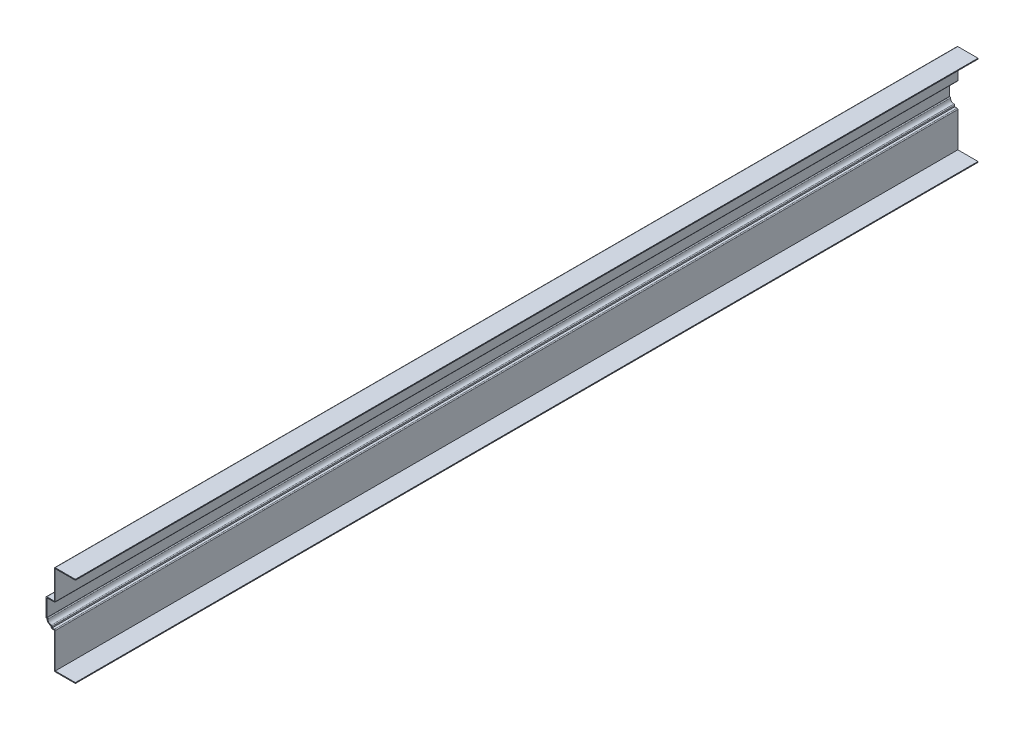
ISO-10303-21;
HEADER;
FILE_DESCRIPTION(('STEP AP214'),'2;1');
FILE_NAME('part.step','',(''),(''),'','','');
FILE_SCHEMA(('AUTOMOTIVE_DESIGN { 1 0 10303 214 1 1 1 1 }'));
ENDSEC;
DATA;
#1=APPLICATION_CONTEXT('core data for automotive mechanical design processes');
#2=APPLICATION_PROTOCOL_DEFINITION('international standard','automotive_design',2000,#1);
#3=PRODUCT_CONTEXT('',#1,'mechanical');
#4=PRODUCT('Part','Part','',(#3));
#5=PRODUCT_RELATED_PRODUCT_CATEGORY('part','',(#4));
#6=PRODUCT_DEFINITION_FORMATION('','',#4);
#7=PRODUCT_DEFINITION_CONTEXT('part definition',#1,'design');
#8=PRODUCT_DEFINITION('design','',#6,#7);
#9=PRODUCT_DEFINITION_SHAPE('','',#8);
#10=(LENGTH_UNIT() NAMED_UNIT(*) SI_UNIT(.MILLI.,.METRE.));
#11=(NAMED_UNIT(*) PLANE_ANGLE_UNIT() SI_UNIT($,.RADIAN.));
#12=(NAMED_UNIT(*) SI_UNIT($,.STERADIAN.) SOLID_ANGLE_UNIT());
#13=UNCERTAINTY_MEASURE_WITH_UNIT(LENGTH_MEASURE(1.E-05),#10,'distance_accuracy_value','');
#14=(GEOMETRIC_REPRESENTATION_CONTEXT(3) GLOBAL_UNCERTAINTY_ASSIGNED_CONTEXT((#13)) GLOBAL_UNIT_ASSIGNED_CONTEXT((#10,
#11,#12)) REPRESENTATION_CONTEXT('',''));
#15=CARTESIAN_POINT('',(0.,0.,0.));
#16=DIRECTION('',(0.,0.,1.));
#17=DIRECTION('',(1.,0.,0.));
#18=AXIS2_PLACEMENT_3D('',#15,#16,#17);
#19=CARTESIAN_POINT('',(-31.75,135.255,-1365.25));
#20=DIRECTION('',(0.,-1.,0.));
#21=DIRECTION('',(0.,0.,-1.));
#22=AXIS2_PLACEMENT_3D('',#19,#20,#21);
#23=PLANE('',#22);
#24=DIRECTION('',(1.,0.,0.));
#25=VECTOR('',#24,1.);
#26=CARTESIAN_POINT('',(-31.75,135.255,0.));
#27=LINE('',#26,#25);
#28=CARTESIAN_POINT('',(-30.48,135.255,0.));
#29=VERTEX_POINT('',#28);
#30=CARTESIAN_POINT('',(0.,135.255,0.));
#31=VERTEX_POINT('',#30);
#32=EDGE_CURVE('E346',#29,#31,#27,.T.);
#33=ORIENTED_EDGE('',*,*,#32,.F.);
#34=DIRECTION('',(0.,0.,1.));
#35=VECTOR('',#34,1.);
#36=CARTESIAN_POINT('',(-30.48,135.255,-1365.25));
#37=LINE('',#36,#35);
#38=CARTESIAN_POINT('',(-30.48,135.255,-1365.25));
#39=VERTEX_POINT('',#38);
#40=EDGE_CURVE('E271',#39,#29,#37,.T.);
#41=ORIENTED_EDGE('',*,*,#40,.F.);
#42=DIRECTION('',(1.,0.,0.));
#43=VECTOR('',#42,1.);
#44=CARTESIAN_POINT('',(-31.75,135.255,-1365.25));
#45=LINE('',#44,#43);
#46=CARTESIAN_POINT('',(0.,135.255,-1365.25));
#47=VERTEX_POINT('',#46);
#48=EDGE_CURVE('E250',#39,#47,#45,.T.);
#49=ORIENTED_EDGE('',*,*,#48,.T.);
#50=DIRECTION('',(0.,0.,1.));
#51=VECTOR('',#50,1.);
#52=CARTESIAN_POINT('',(0.,135.255,-1365.25));
#53=LINE('',#52,#51);
#54=EDGE_CURVE('E258',#47,#31,#53,.T.);
#55=ORIENTED_EDGE('',*,*,#54,.T.);
#56=EDGE_LOOP('',(#33,#41,#49,#55));
#57=FACE_BOUND('',#56,.T.);
#58=ADVANCED_FACE('F41',(#57),#23,.T.);
#59=CARTESIAN_POINT('',(-30.48,92.075,-1365.25));
#60=DIRECTION('',(1.,0.,0.));
#61=DIRECTION('',(0.,0.,-1.));
#62=AXIS2_PLACEMENT_3D('',#59,#60,#61);
#63=PLANE('',#62);
#64=DIRECTION('',(0.,1.,0.));
#65=VECTOR('',#64,1.);
#66=CARTESIAN_POINT('',(-30.48,92.075,0.));
#67=LINE('',#66,#65);
#68=CARTESIAN_POINT('',(-30.48,92.075,0.));
#69=VERTEX_POINT('',#68);
#70=EDGE_CURVE('E273',#69,#29,#67,.T.);
#71=ORIENTED_EDGE('',*,*,#70,.F.);
#72=DIRECTION('',(0.,0.,1.));
#73=VECTOR('',#72,1.);
#74=CARTESIAN_POINT('',(-30.48,92.075,-1365.25));
#75=LINE('',#74,#73);
#76=CARTESIAN_POINT('',(-30.48,92.075,-1365.25));
#77=VERTEX_POINT('',#76);
#78=EDGE_CURVE('E564',#69,#77,#75,.F.);
#79=ORIENTED_EDGE('',*,*,#78,.T.);
#80=DIRECTION('',(0.,1.,0.));
#81=VECTOR('',#80,1.);
#82=CARTESIAN_POINT('',(-30.48,92.075,-1365.25));
#83=LINE('',#82,#81);
#84=EDGE_CURVE('E267',#77,#39,#83,.T.);
#85=ORIENTED_EDGE('',*,*,#84,.T.);
#86=ORIENTED_EDGE('',*,*,#40,.T.);
#87=EDGE_LOOP('',(#71,#79,#85,#86));
#88=FACE_BOUND('',#87,.T.);
#89=ADVANCED_FACE('F580',(#88),#63,.T.);
#90=CARTESIAN_POINT('',(-44.45,90.805,-1365.25));
#91=DIRECTION('',(0.,-1.,0.));
#92=DIRECTION('',(0.,0.,-1.));
#93=AXIS2_PLACEMENT_3D('',#90,#91,#92);
#94=PLANE('',#93);
#95=DIRECTION('',(1.,0.,0.));
#96=VECTOR('',#95,1.);
#97=CARTESIAN_POINT('',(-44.45,90.805,-1365.25));
#98=LINE('',#97,#96);
#99=CARTESIAN_POINT('',(-43.18,90.805,-1365.25));
#100=VERTEX_POINT('',#99);
#101=CARTESIAN_POINT('',(-31.75,90.805,-1365.25));
#102=VERTEX_POINT('',#101);
#103=EDGE_CURVE('E340',#100,#102,#98,.T.);
#104=ORIENTED_EDGE('',*,*,#103,.T.);
#105=DIRECTION('',(0.,0.,1.));
#106=VECTOR('',#105,1.);
#107=CARTESIAN_POINT('',(-31.75,90.805,-1365.25));
#108=LINE('',#107,#106);
#109=CARTESIAN_POINT('',(-31.75,90.805,0.));
#110=VERTEX_POINT('',#109);
#111=EDGE_CURVE('E560',#102,#110,#108,.T.);
#112=ORIENTED_EDGE('',*,*,#111,.T.);
#113=DIRECTION('',(1.,0.,0.));
#114=VECTOR('',#113,1.);
#115=CARTESIAN_POINT('',(-44.45,90.805,0.));
#116=LINE('',#115,#114);
#117=CARTESIAN_POINT('',(-43.18,90.805,0.));
#118=VERTEX_POINT('',#117);
#119=EDGE_CURVE('E276',#118,#110,#116,.T.);
#120=ORIENTED_EDGE('',*,*,#119,.F.);
#121=DIRECTION('',(0.,0.,1.));
#122=VECTOR('',#121,1.);
#123=CARTESIAN_POINT('',(-43.18,90.805,-1365.25));
#124=LINE('',#123,#122);
#125=EDGE_CURVE('E420',#100,#118,#124,.T.);
#126=ORIENTED_EDGE('',*,*,#125,.F.);
#127=EDGE_LOOP('',(#104,#112,#120,#126));
#128=FACE_BOUND('',#127,.T.);
#129=ADVANCED_FACE('F588',(#128),#94,.T.);
#130=CARTESIAN_POINT('',(-43.18,63.5,-1365.25));
#131=DIRECTION('',(1.,0.,0.));
#132=DIRECTION('',(0.,0.,-1.));
#133=AXIS2_PLACEMENT_3D('',#130,#131,#132);
#134=PLANE('',#133);
#135=DIRECTION('',(0.,1.,0.));
#136=VECTOR('',#135,1.);
#137=CARTESIAN_POINT('',(-43.18,63.5,0.));
#138=LINE('',#137,#136);
#139=CARTESIAN_POINT('',(-43.18,64.77,0.));
#140=VERTEX_POINT('',#139);
#141=EDGE_CURVE('E410',#140,#118,#138,.T.);
#142=ORIENTED_EDGE('',*,*,#141,.F.);
#143=DIRECTION('',(0.,0.,1.));
#144=VECTOR('',#143,1.);
#145=CARTESIAN_POINT('',(-43.18,64.77,-1365.25));
#146=LINE('',#145,#144);
#147=CARTESIAN_POINT('',(-43.18,64.77,-1365.25));
#148=VERTEX_POINT('',#147);
#149=EDGE_CURVE('E423',#148,#140,#146,.T.);
#150=ORIENTED_EDGE('',*,*,#149,.F.);
#151=DIRECTION('',(0.,1.,0.));
#152=VECTOR('',#151,1.);
#153=CARTESIAN_POINT('',(-43.18,63.5,-1365.25));
#154=LINE('',#153,#152);
#155=EDGE_CURVE('E336',#148,#100,#154,.T.);
#156=ORIENTED_EDGE('',*,*,#155,.T.);
#157=ORIENTED_EDGE('',*,*,#125,.T.);
#158=EDGE_LOOP('',(#142,#150,#156,#157));
#159=FACE_BOUND('',#158,.T.);
#160=ADVANCED_FACE('F593',(#159),#134,.T.);
#161=CARTESIAN_POINT('',(-42.8625,64.77,-1365.25));
#162=DIRECTION('',(0.,1.,0.));
#163=DIRECTION('',(0.,0.,1.));
#164=AXIS2_PLACEMENT_3D('',#161,#162,#163);
#165=PLANE('',#164);
#166=DIRECTION('',(1.,0.,0.));
#167=VECTOR('',#166,1.);
#168=CARTESIAN_POINT('',(-42.8625,64.77,0.));
#169=LINE('',#168,#167);
#170=CARTESIAN_POINT('',(-42.8625,64.77,0.));
#171=VERTEX_POINT('',#170);
#172=EDGE_CURVE('E407',#171,#140,#169,.F.);
#173=ORIENTED_EDGE('',*,*,#172,.F.);
#174=DIRECTION('',(0.,0.,1.));
#175=VECTOR('',#174,1.);
#176=CARTESIAN_POINT('',(-42.8625,64.77,-1365.25));
#177=LINE('',#176,#175);
#178=CARTESIAN_POINT('',(-42.8625,64.77,-1365.25));
#179=VERTEX_POINT('',#178);
#180=EDGE_CURVE('E543',#171,#179,#177,.F.);
#181=ORIENTED_EDGE('',*,*,#180,.T.);
#182=DIRECTION('',(1.,0.,0.));
#183=VECTOR('',#182,1.);
#184=CARTESIAN_POINT('',(-42.8625,64.77,-1365.25));
#185=LINE('',#184,#183);
#186=EDGE_CURVE('E333',#179,#148,#185,.F.);
#187=ORIENTED_EDGE('',*,*,#186,.T.);
#188=ORIENTED_EDGE('',*,*,#149,.T.);
#189=EDGE_LOOP('',(#173,#181,#187,#188));
#190=FACE_BOUND('',#189,.T.);
#191=ADVANCED_FACE('F900',(#190),#165,.T.);
#192=CARTESIAN_POINT('',(-36.5125,63.5,-1365.25));
#193=DIRECTION('',(0.,0.,1.));
#194=DIRECTION('',(1.,0.,0.));
#195=AXIS2_PLACEMENT_3D('',#192,#193,#194);
#196=CYLINDRICAL_SURFACE('',#195,5.08000000000001);
#197=CARTESIAN_POINT('',(-36.5125,63.5,0.));
#198=DIRECTION('',(0.,0.,1.));
#199=DIRECTION('',(1.,0.,0.));
#200=AXIS2_PLACEMENT_3D('',#197,#198,#199);
#201=CIRCLE('',#200,5.08000000000001);
#202=CARTESIAN_POINT('',(-36.5125,58.42,0.));
#203=VERTEX_POINT('',#202);
#204=CARTESIAN_POINT('',(-41.5925,63.5,0.));
#205=VERTEX_POINT('',#204);
#206=EDGE_CURVE('E403',#203,#205,#201,.F.);
#207=ORIENTED_EDGE('',*,*,#206,.F.);
#208=DIRECTION('',(0.,0.,1.));
#209=VECTOR('',#208,1.);
#210=CARTESIAN_POINT('',(-36.5125,58.42,-1365.25));
#211=LINE('',#210,#209);
#212=CARTESIAN_POINT('',(-36.5125,58.42,-1365.25));
#213=VERTEX_POINT('',#212);
#214=EDGE_CURVE('E540',#203,#213,#211,.F.);
#215=ORIENTED_EDGE('',*,*,#214,.T.);
#216=CARTESIAN_POINT('',(-36.5125,63.5,-1365.25));
#217=DIRECTION('',(0.,0.,1.));
#218=DIRECTION('',(1.,0.,0.));
#219=AXIS2_PLACEMENT_3D('',#216,#217,#218);
#220=CIRCLE('',#219,5.08000000000001);
#221=CARTESIAN_POINT('',(-41.5925,63.5,-1365.25));
#222=VERTEX_POINT('',#221);
#223=EDGE_CURVE('E329',#213,#222,#220,.F.);
#224=ORIENTED_EDGE('',*,*,#223,.T.);
#225=DIRECTION('',(0.,0.,1.));
#226=VECTOR('',#225,1.);
#227=CARTESIAN_POINT('',(-41.5925,63.5,-1365.25));
#228=LINE('',#227,#226);
#229=EDGE_CURVE('E536',#222,#205,#228,.T.);
#230=ORIENTED_EDGE('',*,*,#229,.T.);
#231=EDGE_LOOP('',(#207,#215,#224,#230));
#232=FACE_BOUND('',#231,.T.);
#233=ADVANCED_FACE('F605',(#232),#196,.F.);
#234=CARTESIAN_POINT('',(-35.2425,53.975,-1365.25));
#235=DIRECTION('',(1.,0.,0.));
#236=DIRECTION('',(0.,0.,-1.));
#237=AXIS2_PLACEMENT_3D('',#234,#235,#236);
#238=PLANE('',#237);
#239=DIRECTION('',(0.,1.,0.));
#240=VECTOR('',#239,1.);
#241=CARTESIAN_POINT('',(-35.2425,53.975,-1365.25));
#242=LINE('',#241,#240);
#243=CARTESIAN_POINT('',(-35.2425,55.245,-1365.25));
#244=VERTEX_POINT('',#243);
#245=CARTESIAN_POINT('',(-35.2425,57.15,-1365.25));
#246=VERTEX_POINT('',#245);
#247=EDGE_CURVE('E325',#244,#246,#242,.T.);
#248=ORIENTED_EDGE('',*,*,#247,.T.);
#249=DIRECTION('',(0.,0.,1.));
#250=VECTOR('',#249,1.);
#251=CARTESIAN_POINT('',(-35.2425,57.15,-1365.25));
#252=LINE('',#251,#250);
#253=CARTESIAN_POINT('',(-35.2425,57.15,0.));
#254=VERTEX_POINT('',#253);
#255=EDGE_CURVE('E532',#246,#254,#252,.T.);
#256=ORIENTED_EDGE('',*,*,#255,.T.);
#257=DIRECTION('',(0.,1.,0.));
#258=VECTOR('',#257,1.);
#259=CARTESIAN_POINT('',(-35.2425,53.975,0.));
#260=LINE('',#259,#258);
#261=CARTESIAN_POINT('',(-35.2425,55.245,0.));
#262=VERTEX_POINT('',#261);
#263=EDGE_CURVE('E399',#262,#254,#260,.T.);
#264=ORIENTED_EDGE('',*,*,#263,.F.);
#265=DIRECTION('',(0.,0.,1.));
#266=VECTOR('',#265,1.);
#267=CARTESIAN_POINT('',(-35.2425,55.245,-1365.25));
#268=LINE('',#267,#266);
#269=EDGE_CURVE('E427',#244,#262,#268,.T.);
#270=ORIENTED_EDGE('',*,*,#269,.F.);
#271=EDGE_LOOP('',(#248,#256,#264,#270));
#272=FACE_BOUND('',#271,.T.);
#273=ADVANCED_FACE('F613',(#272),#238,.T.);
#274=CARTESIAN_POINT('',(-31.75,55.245,-1365.25));
#275=DIRECTION('',(0.,1.,0.));
#276=DIRECTION('',(-1.,0.,0.));
#277=AXIS2_PLACEMENT_3D('',#274,#275,#276);
#278=PLANE('',#277);
#279=DIRECTION('',(-1.,0.,0.));
#280=VECTOR('',#279,1.);
#281=CARTESIAN_POINT('',(-31.75,55.245,0.));
#282=LINE('',#281,#280);
#283=CARTESIAN_POINT('',(-31.75,55.245,0.));
#284=VERTEX_POINT('',#283);
#285=EDGE_CURVE('E396',#284,#262,#282,.T.);
#286=ORIENTED_EDGE('',*,*,#285,.F.);
#287=DIRECTION('',(0.,0.,1.));
#288=VECTOR('',#287,1.);
#289=CARTESIAN_POINT('',(-31.75,55.245,-1365.25));
#290=LINE('',#289,#288);
#291=CARTESIAN_POINT('',(-31.75,55.245,-1365.25));
#292=VERTEX_POINT('',#291);
#293=EDGE_CURVE('E522',#284,#292,#290,.F.);
#294=ORIENTED_EDGE('',*,*,#293,.T.);
#295=DIRECTION('',(-1.,0.,0.));
#296=VECTOR('',#295,1.);
#297=CARTESIAN_POINT('',(-31.75,55.245,-1365.25));
#298=LINE('',#297,#296);
#299=EDGE_CURVE('E322',#292,#244,#298,.T.);
#300=ORIENTED_EDGE('',*,*,#299,.T.);
#301=ORIENTED_EDGE('',*,*,#269,.T.);
#302=EDGE_LOOP('',(#286,#294,#300,#301));
#303=FACE_BOUND('',#302,.T.);
#304=ADVANCED_FACE('F878',(#303),#278,.T.);
#305=CARTESIAN_POINT('',(-30.48,0.,-1365.25));
#306=DIRECTION('',(1.,0.,0.));
#307=DIRECTION('',(0.,0.,-1.));
#308=AXIS2_PLACEMENT_3D('',#305,#306,#307);
#309=PLANE('',#308);
#310=DIRECTION('',(0.,1.,0.));
#311=VECTOR('',#310,1.);
#312=CARTESIAN_POINT('',(-30.48,0.,-1365.25));
#313=LINE('',#312,#311);
#314=CARTESIAN_POINT('',(-30.48,1.27,-1365.25));
#315=VERTEX_POINT('',#314);
#316=CARTESIAN_POINT('',(-30.48,53.975,-1365.25));
#317=VERTEX_POINT('',#316);
#318=EDGE_CURVE('E318',#315,#317,#313,.T.);
#319=ORIENTED_EDGE('',*,*,#318,.T.);
#320=DIRECTION('',(0.,0.,1.));
#321=VECTOR('',#320,1.);
#322=CARTESIAN_POINT('',(-30.48,53.975,-1365.25));
#323=LINE('',#322,#321);
#324=CARTESIAN_POINT('',(-30.48,53.975,0.));
#325=VERTEX_POINT('',#324);
#326=EDGE_CURVE('E518',#317,#325,#323,.T.);
#327=ORIENTED_EDGE('',*,*,#326,.T.);
#328=DIRECTION('',(0.,1.,0.));
#329=VECTOR('',#328,1.);
#330=CARTESIAN_POINT('',(-30.48,0.,0.));
#331=LINE('',#330,#329);
#332=CARTESIAN_POINT('',(-30.48,1.27,0.));
#333=VERTEX_POINT('',#332);
#334=EDGE_CURVE('E392',#333,#325,#331,.T.);
#335=ORIENTED_EDGE('',*,*,#334,.F.);
#336=DIRECTION('',(0.,0.,1.));
#337=VECTOR('',#336,1.);
#338=CARTESIAN_POINT('',(-30.48,1.27,-1365.25));
#339=LINE('',#338,#337);
#340=EDGE_CURVE('E431',#315,#333,#339,.T.);
#341=ORIENTED_EDGE('',*,*,#340,.F.);
#342=EDGE_LOOP('',(#319,#327,#335,#341));
#343=FACE_BOUND('',#342,.T.);
#344=ADVANCED_FACE('F626',(#343),#309,.T.);
#345=CARTESIAN_POINT('',(0.,1.27,-1365.25));
#346=DIRECTION('',(0.,1.,0.));
#347=DIRECTION('',(0.,0.,1.));
#348=AXIS2_PLACEMENT_3D('',#345,#346,#347);
#349=PLANE('',#348);
#350=DIRECTION('',(1.,0.,0.));
#351=VECTOR('',#350,1.);
#352=CARTESIAN_POINT('',(0.,1.27,0.));
#353=LINE('',#352,#351);
#354=CARTESIAN_POINT('',(0.,1.27,0.));
#355=VERTEX_POINT('',#354);
#356=EDGE_CURVE('E388',#355,#333,#353,.F.);
#357=ORIENTED_EDGE('',*,*,#356,.F.);
#358=DIRECTION('',(0.,0.,1.));
#359=VECTOR('',#358,1.);
#360=CARTESIAN_POINT('',(0.,1.27,-1365.25));
#361=LINE('',#360,#359);
#362=CARTESIAN_POINT('',(0.,1.27,-1365.25));
#363=VERTEX_POINT('',#362);
#364=EDGE_CURVE('E434',#363,#355,#361,.T.);
#365=ORIENTED_EDGE('',*,*,#364,.F.);
#366=DIRECTION('',(1.,0.,0.));
#367=VECTOR('',#366,1.);
#368=CARTESIAN_POINT('',(0.,1.27,-1365.25));
#369=LINE('',#368,#367);
#370=EDGE_CURVE('E314',#363,#315,#369,.F.);
#371=ORIENTED_EDGE('',*,*,#370,.T.);
#372=ORIENTED_EDGE('',*,*,#340,.T.);
#373=EDGE_LOOP('',(#357,#365,#371,#372));
#374=FACE_BOUND('',#373,.T.);
#375=ADVANCED_FACE('F632',(#374),#349,.T.);
#376=CARTESIAN_POINT('',(0.,1.27,-1365.25));
#377=DIRECTION('',(-1.,0.,0.));
#378=DIRECTION('',(0.,0.,1.));
#379=AXIS2_PLACEMENT_3D('',#376,#377,#378);
#380=PLANE('',#379);
#381=DIRECTION('',(0.,-1.,0.));
#382=VECTOR('',#381,1.);
#383=CARTESIAN_POINT('',(0.,1.27,0.));
#384=LINE('',#383,#382);
#385=CARTESIAN_POINT('',(0.,0.,0.));
#386=VERTEX_POINT('',#385);
#387=EDGE_CURVE('E385',#355,#386,#384,.T.);
#388=ORIENTED_EDGE('',*,*,#387,.T.);
#389=DIRECTION('',(0.,0.,1.));
#390=VECTOR('',#389,1.);
#391=CARTESIAN_POINT('',(0.,0.,-1365.25));
#392=LINE('',#391,#390);
#393=CARTESIAN_POINT('',(0.,0.,-1365.25));
#394=VERTEX_POINT('',#393);
#395=EDGE_CURVE('E437',#394,#386,#392,.T.);
#396=ORIENTED_EDGE('',*,*,#395,.F.);
#397=DIRECTION('',(0.,-1.,0.));
#398=VECTOR('',#397,1.);
#399=CARTESIAN_POINT('',(0.,1.27,-1365.25));
#400=LINE('',#399,#398);
#401=EDGE_CURVE('E311',#363,#394,#400,.T.);
#402=ORIENTED_EDGE('',*,*,#401,.F.);
#403=ORIENTED_EDGE('',*,*,#364,.T.);
#404=EDGE_LOOP('',(#388,#396,#402,#403));
#405=FACE_BOUND('',#404,.T.);
#406=ADVANCED_FACE('F639',(#405),#380,.F.);
#407=CARTESIAN_POINT('',(0.,0.,-1365.25));
#408=DIRECTION('',(0.,1.,0.));
#409=DIRECTION('',(0.,0.,1.));
#410=AXIS2_PLACEMENT_3D('',#407,#408,#409);
#411=PLANE('',#410);
#412=DIRECTION('',(-1.,0.,0.));
#413=VECTOR('',#412,1.);
#414=CARTESIAN_POINT('',(0.,0.,0.));
#415=LINE('',#414,#413);
#416=CARTESIAN_POINT('',(-30.48,0.,0.));
#417=VERTEX_POINT('',#416);
#418=EDGE_CURVE('E381',#386,#417,#415,.T.);
#419=ORIENTED_EDGE('',*,*,#418,.T.);
#420=DIRECTION('',(0.,0.,1.));
#421=VECTOR('',#420,1.);
#422=CARTESIAN_POINT('',(-30.48,0.,-1365.25));
#423=LINE('',#422,#421);
#424=CARTESIAN_POINT('',(-30.48,0.,-1365.25));
#425=VERTEX_POINT('',#424);
#426=EDGE_CURVE('E489',#417,#425,#423,.F.);
#427=ORIENTED_EDGE('',*,*,#426,.T.);
#428=DIRECTION('',(-1.,0.,0.));
#429=VECTOR('',#428,1.);
#430=CARTESIAN_POINT('',(0.,0.,-1365.25));
#431=LINE('',#430,#429);
#432=EDGE_CURVE('E308',#394,#425,#431,.T.);
#433=ORIENTED_EDGE('',*,*,#432,.F.);
#434=ORIENTED_EDGE('',*,*,#395,.T.);
#435=EDGE_LOOP('',(#419,#427,#433,#434));
#436=FACE_BOUND('',#435,.T.);
#437=ADVANCED_FACE('F641',(#436),#411,.F.);
#438=CARTESIAN_POINT('',(-31.75,0.,-1365.25));
#439=DIRECTION('',(1.,0.,0.));
#440=DIRECTION('',(0.,0.,-1.));
#441=AXIS2_PLACEMENT_3D('',#438,#439,#440);
#442=PLANE('',#441);
#443=DIRECTION('',(0.,1.,0.));
#444=VECTOR('',#443,1.);
#445=CARTESIAN_POINT('',(-31.75,0.,-1365.25));
#446=LINE('',#445,#444);
#447=CARTESIAN_POINT('',(-31.75,1.27,-1365.25));
#448=VERTEX_POINT('',#447);
#449=CARTESIAN_POINT('',(-31.75,53.975,-1365.25));
#450=VERTEX_POINT('',#449);
#451=EDGE_CURVE('E305',#448,#450,#446,.T.);
#452=ORIENTED_EDGE('',*,*,#451,.F.);
#453=DIRECTION('',(0.,0.,1.));
#454=VECTOR('',#453,1.);
#455=CARTESIAN_POINT('',(-31.75,1.27,-1365.25));
#456=LINE('',#455,#454);
#457=CARTESIAN_POINT('',(-31.75,1.27,0.));
#458=VERTEX_POINT('',#457);
#459=EDGE_CURVE('E419',#448,#458,#456,.T.);
#460=ORIENTED_EDGE('',*,*,#459,.T.);
#461=DIRECTION('',(0.,1.,0.));
#462=VECTOR('',#461,1.);
#463=CARTESIAN_POINT('',(-31.75,0.,0.));
#464=LINE('',#463,#462);
#465=CARTESIAN_POINT('',(-31.75,53.975,0.));
#466=VERTEX_POINT('',#465);
#467=EDGE_CURVE('E378',#458,#466,#464,.T.);
#468=ORIENTED_EDGE('',*,*,#467,.T.);
#469=DIRECTION('',(0.,0.,1.));
#470=VECTOR('',#469,1.);
#471=CARTESIAN_POINT('',(-31.75,53.975,-1365.25));
#472=LINE('',#471,#470);
#473=EDGE_CURVE('E441',#450,#466,#472,.T.);
#474=ORIENTED_EDGE('',*,*,#473,.F.);
#475=EDGE_LOOP('',(#452,#460,#468,#474));
#476=FACE_BOUND('',#475,.T.);
#477=ADVANCED_FACE('F649',(#476),#442,.F.);
#478=CARTESIAN_POINT('',(-31.75,53.975,-1365.25));
#479=DIRECTION('',(0.,1.,0.));
#480=DIRECTION('',(-1.,0.,0.));
#481=AXIS2_PLACEMENT_3D('',#478,#479,#480);
#482=PLANE('',#481);
#483=DIRECTION('',(-1.,0.,0.));
#484=VECTOR('',#483,1.);
#485=CARTESIAN_POINT('',(-31.75,53.975,0.));
#486=LINE('',#485,#484);
#487=CARTESIAN_POINT('',(-35.2425,53.975,0.));
#488=VERTEX_POINT('',#487);
#489=EDGE_CURVE('E374',#466,#488,#486,.T.);
#490=ORIENTED_EDGE('',*,*,#489,.T.);
#491=DIRECTION('',(0.,0.,1.));
#492=VECTOR('',#491,1.);
#493=CARTESIAN_POINT('',(-35.2425,53.975,-1365.25));
#494=LINE('',#493,#492);
#495=CARTESIAN_POINT('',(-35.2425,53.975,-1365.25));
#496=VERTEX_POINT('',#495);
#497=EDGE_CURVE('E529',#488,#496,#494,.F.);
#498=ORIENTED_EDGE('',*,*,#497,.T.);
#499=DIRECTION('',(-1.,0.,0.));
#500=VECTOR('',#499,1.);
#501=CARTESIAN_POINT('',(-31.75,53.975,-1365.25));
#502=LINE('',#501,#500);
#503=EDGE_CURVE('E301',#450,#496,#502,.T.);
#504=ORIENTED_EDGE('',*,*,#503,.F.);
#505=ORIENTED_EDGE('',*,*,#473,.T.);
#506=EDGE_LOOP('',(#490,#498,#504,#505));
#507=FACE_BOUND('',#506,.T.);
#508=ADVANCED_FACE('F653',(#507),#482,.F.);
#509=CARTESIAN_POINT('',(-36.5125,53.975,-1365.25));
#510=DIRECTION('',(1.,0.,0.));
#511=DIRECTION('',(0.,0.,-1.));
#512=AXIS2_PLACEMENT_3D('',#509,#510,#511);
#513=PLANE('',#512);
#514=DIRECTION('',(0.,1.,0.));
#515=VECTOR('',#514,1.);
#516=CARTESIAN_POINT('',(-36.5125,53.975,-1365.25));
#517=LINE('',#516,#515);
#518=CARTESIAN_POINT('',(-36.5125,55.245,-1365.25));
#519=VERTEX_POINT('',#518);
#520=CARTESIAN_POINT('',(-36.5125,57.15,-1365.25));
#521=VERTEX_POINT('',#520);
#522=EDGE_CURVE('E298',#519,#521,#517,.T.);
#523=ORIENTED_EDGE('',*,*,#522,.F.);
#524=DIRECTION('',(0.,0.,1.));
#525=VECTOR('',#524,1.);
#526=CARTESIAN_POINT('',(-36.5125,55.245,-1365.25));
#527=LINE('',#526,#525);
#528=CARTESIAN_POINT('',(-36.5125,55.245,0.));
#529=VERTEX_POINT('',#528);
#530=EDGE_CURVE('E525',#519,#529,#527,.T.);
#531=ORIENTED_EDGE('',*,*,#530,.T.);
#532=DIRECTION('',(0.,1.,0.));
#533=VECTOR('',#532,1.);
#534=CARTESIAN_POINT('',(-36.5125,53.975,0.));
#535=LINE('',#534,#533);
#536=CARTESIAN_POINT('',(-36.5125,57.15,0.));
#537=VERTEX_POINT('',#536);
#538=EDGE_CURVE('E371',#529,#537,#535,.T.);
#539=ORIENTED_EDGE('',*,*,#538,.T.);
#540=DIRECTION('',(0.,0.,1.));
#541=VECTOR('',#540,1.);
#542=CARTESIAN_POINT('',(-36.5125,57.15,-1365.25));
#543=LINE('',#542,#541);
#544=EDGE_CURVE('E445',#521,#537,#543,.T.);
#545=ORIENTED_EDGE('',*,*,#544,.F.);
#546=EDGE_LOOP('',(#523,#531,#539,#545));
#547=FACE_BOUND('',#546,.T.);
#548=ADVANCED_FACE('F662',(#547),#513,.F.);
#549=CARTESIAN_POINT('',(-36.5125,63.5,-1365.25));
#550=DIRECTION('',(0.,0.,1.));
#551=DIRECTION('',(1.,0.,0.));
#552=AXIS2_PLACEMENT_3D('',#549,#550,#551);
#553=CYLINDRICAL_SURFACE('',#552,6.35000000000001);
#554=CARTESIAN_POINT('',(-36.5125,63.5,0.));
#555=DIRECTION('',(0.,0.,-1.));
#556=DIRECTION('',(-1.,0.,0.));
#557=AXIS2_PLACEMENT_3D('',#554,#555,#556);
#558=CIRCLE('',#557,6.35000000000001);
#559=CARTESIAN_POINT('',(-42.8625,63.5,0.));
#560=VERTEX_POINT('',#559);
#561=EDGE_CURVE('E368',#537,#560,#558,.T.);
#562=ORIENTED_EDGE('',*,*,#561,.T.);
#563=DIRECTION('',(0.,0.,1.));
#564=VECTOR('',#563,1.);
#565=CARTESIAN_POINT('',(-42.8625,63.5,-1365.25));
#566=LINE('',#565,#564);
#567=CARTESIAN_POINT('',(-42.8625,63.5,-1365.25));
#568=VERTEX_POINT('',#567);
#569=EDGE_CURVE('E449',#568,#560,#566,.T.);
#570=ORIENTED_EDGE('',*,*,#569,.F.);
#571=CARTESIAN_POINT('',(-36.5125,63.5,-1365.25));
#572=DIRECTION('',(0.,0.,-1.));
#573=DIRECTION('',(-1.,0.,0.));
#574=AXIS2_PLACEMENT_3D('',#571,#572,#573);
#575=CIRCLE('',#574,6.35000000000001);
#576=EDGE_CURVE('E295',#521,#568,#575,.T.);
#577=ORIENTED_EDGE('',*,*,#576,.F.);
#578=ORIENTED_EDGE('',*,*,#544,.T.);
#579=EDGE_LOOP('',(#562,#570,#577,#578));
#580=FACE_BOUND('',#579,.T.);
#581=ADVANCED_FACE('F668',(#580),#553,.T.);
#582=CARTESIAN_POINT('',(-42.8625,63.5,-1365.25));
#583=DIRECTION('',(0.,1.,0.));
#584=DIRECTION('',(0.,0.,1.));
#585=AXIS2_PLACEMENT_3D('',#582,#583,#584);
#586=PLANE('',#585);
#587=DIRECTION('',(-1.,0.,0.));
#588=VECTOR('',#587,1.);
#589=CARTESIAN_POINT('',(-42.8625,63.5,0.));
#590=LINE('',#589,#588);
#591=CARTESIAN_POINT('',(-43.18,63.5,0.));
#592=VERTEX_POINT('',#591);
#593=EDGE_CURVE('E364',#560,#592,#590,.T.);
#594=ORIENTED_EDGE('',*,*,#593,.T.);
#595=DIRECTION('',(0.,0.,1.));
#596=VECTOR('',#595,1.);
#597=CARTESIAN_POINT('',(-43.18,63.5,-1365.25));
#598=LINE('',#597,#596);
#599=CARTESIAN_POINT('',(-43.18,63.5,-1365.25));
#600=VERTEX_POINT('',#599);
#601=EDGE_CURVE('E553',#592,#600,#598,.F.);
#602=ORIENTED_EDGE('',*,*,#601,.T.);
#603=DIRECTION('',(-1.,0.,0.));
#604=VECTOR('',#603,1.);
#605=CARTESIAN_POINT('',(-42.8625,63.5,-1365.25));
#606=LINE('',#605,#604);
#607=EDGE_CURVE('E291',#568,#600,#606,.T.);
#608=ORIENTED_EDGE('',*,*,#607,.F.);
#609=ORIENTED_EDGE('',*,*,#569,.T.);
#610=EDGE_LOOP('',(#594,#602,#608,#609));
#611=FACE_BOUND('',#610,.T.);
#612=ADVANCED_FACE('F672',(#611),#586,.F.);
#613=CARTESIAN_POINT('',(-44.45,63.5,-1365.25));
#614=DIRECTION('',(1.,0.,0.));
#615=DIRECTION('',(0.,0.,-1.));
#616=AXIS2_PLACEMENT_3D('',#613,#614,#615);
#617=PLANE('',#616);
#618=DIRECTION('',(0.,1.,0.));
#619=VECTOR('',#618,1.);
#620=CARTESIAN_POINT('',(-44.45,63.5,-1365.25));
#621=LINE('',#620,#619);
#622=CARTESIAN_POINT('',(-44.45,64.77,-1365.25));
#623=VERTEX_POINT('',#622);
#624=CARTESIAN_POINT('',(-44.45,90.805,-1365.25));
#625=VERTEX_POINT('',#624);
#626=EDGE_CURVE('E287',#623,#625,#621,.T.);
#627=ORIENTED_EDGE('',*,*,#626,.F.);
#628=DIRECTION('',(0.,0.,1.));
#629=VECTOR('',#628,1.);
#630=CARTESIAN_POINT('',(-44.45,64.77,-1365.25));
#631=LINE('',#630,#629);
#632=CARTESIAN_POINT('',(-44.45,64.77,0.));
#633=VERTEX_POINT('',#632);
#634=EDGE_CURVE('E549',#623,#633,#631,.T.);
#635=ORIENTED_EDGE('',*,*,#634,.T.);
#636=DIRECTION('',(0.,1.,0.));
#637=VECTOR('',#636,1.);
#638=CARTESIAN_POINT('',(-44.45,63.5,0.));
#639=LINE('',#638,#637);
#640=CARTESIAN_POINT('',(-44.45,90.805,0.));
#641=VERTEX_POINT('',#640);
#642=EDGE_CURVE('E360',#633,#641,#639,.T.);
#643=ORIENTED_EDGE('',*,*,#642,.T.);
#644=DIRECTION('',(0.,0.,1.));
#645=VECTOR('',#644,1.);
#646=CARTESIAN_POINT('',(-44.45,90.805,-1365.25));
#647=LINE('',#646,#645);
#648=EDGE_CURVE('E546',#641,#625,#647,.F.);
#649=ORIENTED_EDGE('',*,*,#648,.T.);
#650=EDGE_LOOP('',(#627,#635,#643,#649));
#651=FACE_BOUND('',#650,.T.);
#652=ADVANCED_FACE('F681',(#651),#617,.F.);
#653=CARTESIAN_POINT('',(-44.45,92.075,-1365.25));
#654=DIRECTION('',(0.,-1.,0.));
#655=DIRECTION('',(0.,0.,-1.));
#656=AXIS2_PLACEMENT_3D('',#653,#654,#655);
#657=PLANE('',#656);
#658=DIRECTION('',(1.,0.,0.));
#659=VECTOR('',#658,1.);
#660=CARTESIAN_POINT('',(-44.45,92.075,-1365.25));
#661=LINE('',#660,#659);
#662=CARTESIAN_POINT('',(-43.18,92.075,-1365.25));
#663=VERTEX_POINT('',#662);
#664=CARTESIAN_POINT('',(-31.75,92.075,-1365.25));
#665=VERTEX_POINT('',#664);
#666=EDGE_CURVE('E284',#663,#665,#661,.T.);
#667=ORIENTED_EDGE('',*,*,#666,.F.);
#668=DIRECTION('',(0.,0.,1.));
#669=VECTOR('',#668,1.);
#670=CARTESIAN_POINT('',(-43.18,92.075,-1365.25));
#671=LINE('',#670,#669);
#672=CARTESIAN_POINT('',(-43.18,92.075,0.));
#673=VERTEX_POINT('',#672);
#674=EDGE_CURVE('E556',#663,#673,#671,.T.);
#675=ORIENTED_EDGE('',*,*,#674,.T.);
#676=DIRECTION('',(1.,0.,0.));
#677=VECTOR('',#676,1.);
#678=CARTESIAN_POINT('',(-44.45,92.075,0.));
#679=LINE('',#678,#677);
#680=CARTESIAN_POINT('',(-31.75,92.075,0.));
#681=VERTEX_POINT('',#680);
#682=EDGE_CURVE('E357',#673,#681,#679,.T.);
#683=ORIENTED_EDGE('',*,*,#682,.T.);
#684=DIRECTION('',(0.,0.,1.));
#685=VECTOR('',#684,1.);
#686=CARTESIAN_POINT('',(-31.75,92.075,-1365.25));
#687=LINE('',#686,#685);
#688=EDGE_CURVE('E453',#665,#681,#687,.T.);
#689=ORIENTED_EDGE('',*,*,#688,.F.);
#690=EDGE_LOOP('',(#667,#675,#683,#689));
#691=FACE_BOUND('',#690,.T.);
#692=ADVANCED_FACE('F690',(#691),#657,.F.);
#693=CARTESIAN_POINT('',(-31.75,92.075,-1365.25));
#694=DIRECTION('',(1.,0.,0.));
#695=DIRECTION('',(0.,0.,-1.));
#696=AXIS2_PLACEMENT_3D('',#693,#694,#695);
#697=PLANE('',#696);
#698=DIRECTION('',(0.,1.,0.));
#699=VECTOR('',#698,1.);
#700=CARTESIAN_POINT('',(-31.75,92.075,0.));
#701=LINE('',#700,#699);
#702=CARTESIAN_POINT('',(-31.75,135.255,0.));
#703=VERTEX_POINT('',#702);
#704=EDGE_CURVE('E354',#681,#703,#701,.T.);
#705=ORIENTED_EDGE('',*,*,#704,.T.);
#706=DIRECTION('',(0.,0.,1.));
#707=VECTOR('',#706,1.);
#708=CARTESIAN_POINT('',(-31.75,135.255,-1365.25));
#709=LINE('',#708,#707);
#710=CARTESIAN_POINT('',(-31.75,135.255,-1365.25));
#711=VERTEX_POINT('',#710);
#712=EDGE_CURVE('E11',#703,#711,#709,.F.);
#713=ORIENTED_EDGE('',*,*,#712,.T.);
#714=DIRECTION('',(0.,1.,0.));
#715=VECTOR('',#714,1.);
#716=CARTESIAN_POINT('',(-31.75,92.075,-1365.25));
#717=LINE('',#716,#715);
#718=EDGE_CURVE('E281',#665,#711,#717,.T.);
#719=ORIENTED_EDGE('',*,*,#718,.F.);
#720=ORIENTED_EDGE('',*,*,#688,.T.);
#721=EDGE_LOOP('',(#705,#713,#719,#720));
#722=FACE_BOUND('',#721,.T.);
#723=ADVANCED_FACE('F794',(#722),#697,.F.);
#724=CARTESIAN_POINT('',(-31.75,136.525,-1365.25));
#725=DIRECTION('',(0.,-1.,0.));
#726=DIRECTION('',(0.,0.,-1.));
#727=AXIS2_PLACEMENT_3D('',#724,#725,#726);
#728=PLANE('',#727);
#729=DIRECTION('',(1.,0.,0.));
#730=VECTOR('',#729,1.);
#731=CARTESIAN_POINT('',(-31.75,136.525,-1365.25));
#732=LINE('',#731,#730);
#733=CARTESIAN_POINT('',(-30.48,136.525,-1365.25));
#734=VERTEX_POINT('',#733);
#735=CARTESIAN_POINT('',(0.,136.525,-1365.25));
#736=VERTEX_POINT('',#735);
#737=EDGE_CURVE('E251',#734,#736,#732,.T.);
#738=ORIENTED_EDGE('',*,*,#737,.F.);
#739=DIRECTION('',(0.,0.,1.));
#740=VECTOR('',#739,1.);
#741=CARTESIAN_POINT('',(-30.48,136.525,-1365.25));
#742=LINE('',#741,#740);
#743=CARTESIAN_POINT('',(-30.48,136.525,0.));
#744=VERTEX_POINT('',#743);
#745=EDGE_CURVE('E50',#734,#744,#742,.T.);
#746=ORIENTED_EDGE('',*,*,#745,.T.);
#747=DIRECTION('',(1.,0.,0.));
#748=VECTOR('',#747,1.);
#749=CARTESIAN_POINT('',(-31.75,136.525,0.));
#750=LINE('',#749,#748);
#751=CARTESIAN_POINT('',(0.,136.525,0.));
#752=VERTEX_POINT('',#751);
#753=EDGE_CURVE('E351',#744,#752,#750,.T.);
#754=ORIENTED_EDGE('',*,*,#753,.T.);
#755=DIRECTION('',(0.,0.,1.));
#756=VECTOR('',#755,1.);
#757=CARTESIAN_POINT('',(0.,136.525,-1365.25));
#758=LINE('',#757,#756);
#759=EDGE_CURVE('E266',#736,#752,#758,.T.);
#760=ORIENTED_EDGE('',*,*,#759,.F.);
#761=EDGE_LOOP('',(#738,#746,#754,#760));
#762=FACE_BOUND('',#761,.T.);
#763=ADVANCED_FACE('F571',(#762),#728,.F.);
#764=CARTESIAN_POINT('',(0.,136.525,-1365.25));
#765=DIRECTION('',(-1.,0.,0.));
#766=DIRECTION('',(0.,-1.,0.));
#767=AXIS2_PLACEMENT_3D('',#764,#765,#766);
#768=PLANE('',#767);
#769=DIRECTION('',(0.,-1.,0.));
#770=VECTOR('',#769,1.);
#771=CARTESIAN_POINT('',(0.,136.525,0.));
#772=LINE('',#771,#770);
#773=EDGE_CURVE('E261',#752,#31,#772,.T.);
#774=ORIENTED_EDGE('',*,*,#773,.T.);
#775=ORIENTED_EDGE('',*,*,#54,.F.);
#776=DIRECTION('',(0.,-1.,0.));
#777=VECTOR('',#776,1.);
#778=CARTESIAN_POINT('',(0.,136.525,-1365.25));
#779=LINE('',#778,#777);
#780=EDGE_CURVE('E244',#736,#47,#779,.T.);
#781=ORIENTED_EDGE('',*,*,#780,.F.);
#782=ORIENTED_EDGE('',*,*,#759,.T.);
#783=EDGE_LOOP('',(#774,#775,#781,#782));
#784=FACE_BOUND('',#783,.T.);
#785=ADVANCED_FACE('F259',(#784),#768,.F.);
#786=CARTESIAN_POINT('',(-36.5125,63.5,-1365.25));
#787=DIRECTION('',(0.,0.,-1.));
#788=DIRECTION('',(-1.,0.,0.));
#789=AXIS2_PLACEMENT_3D('',#786,#787,#788);
#790=PLANE('',#789);
#791=ORIENTED_EDGE('',*,*,#432,.T.);
#792=CARTESIAN_POINT('',(-30.48,1.27,-1365.25));
#793=DIRECTION('',(0.,0.,-1.));
#794=DIRECTION('',(-1.,0.,0.));
#795=AXIS2_PLACEMENT_3D('',#792,#793,#794);
#796=CIRCLE('',#795,1.27);
#797=EDGE_CURVE('E515',#425,#448,#796,.T.);
#798=ORIENTED_EDGE('',*,*,#797,.T.);
#799=ORIENTED_EDGE('',*,*,#451,.T.);
#800=ORIENTED_EDGE('',*,*,#503,.T.);
#801=CARTESIAN_POINT('',(-35.2425,55.245,-1365.25));
#802=DIRECTION('',(0.,0.,-1.));
#803=DIRECTION('',(-1.,0.,0.));
#804=AXIS2_PLACEMENT_3D('',#801,#802,#803);
#805=CIRCLE('',#804,1.27);
#806=EDGE_CURVE('E509',#496,#519,#805,.T.);
#807=ORIENTED_EDGE('',*,*,#806,.T.);
#808=ORIENTED_EDGE('',*,*,#522,.T.);
#809=ORIENTED_EDGE('',*,*,#576,.T.);
#810=ORIENTED_EDGE('',*,*,#607,.T.);
#811=CARTESIAN_POINT('',(-43.18,64.77,-1365.25));
#812=DIRECTION('',(0.,0.,-1.));
#813=DIRECTION('',(-1.,0.,0.));
#814=AXIS2_PLACEMENT_3D('',#811,#812,#813);
#815=CIRCLE('',#814,1.27);
#816=EDGE_CURVE('E500',#600,#623,#815,.T.);
#817=ORIENTED_EDGE('',*,*,#816,.T.);
#818=ORIENTED_EDGE('',*,*,#626,.T.);
#819=CARTESIAN_POINT('',(-43.18,90.805,-1365.25));
#820=DIRECTION('',(0.,0.,-1.));
#821=DIRECTION('',(-1.,0.,0.));
#822=AXIS2_PLACEMENT_3D('',#819,#820,#821);
#823=CIRCLE('',#822,1.27);
#824=EDGE_CURVE('E497',#625,#663,#823,.T.);
#825=ORIENTED_EDGE('',*,*,#824,.T.);
#826=ORIENTED_EDGE('',*,*,#666,.T.);
#827=ORIENTED_EDGE('',*,*,#718,.T.);
#828=CARTESIAN_POINT('',(-30.48,135.255,-1365.25));
#829=DIRECTION('',(0.,0.,-1.));
#830=DIRECTION('',(-1.,0.,0.));
#831=AXIS2_PLACEMENT_3D('',#828,#829,#830);
#832=CIRCLE('',#831,1.27);
#833=EDGE_CURVE('E57',#711,#734,#832,.T.);
#834=ORIENTED_EDGE('',*,*,#833,.T.);
#835=ORIENTED_EDGE('',*,*,#737,.T.);
#836=ORIENTED_EDGE('',*,*,#780,.T.);
#837=ORIENTED_EDGE('',*,*,#48,.F.);
#838=ORIENTED_EDGE('',*,*,#84,.F.);
#839=CARTESIAN_POINT('',(-31.75,92.075,-1365.25));
#840=DIRECTION('',(0.,0.,-1.));
#841=DIRECTION('',(-1.,0.,0.));
#842=AXIS2_PLACEMENT_3D('',#839,#840,#841);
#843=CIRCLE('',#842,1.27);
#844=EDGE_CURVE('E494',#77,#102,#843,.T.);
#845=ORIENTED_EDGE('',*,*,#844,.T.);
#846=ORIENTED_EDGE('',*,*,#103,.F.);
#847=ORIENTED_EDGE('',*,*,#155,.F.);
#848=ORIENTED_EDGE('',*,*,#186,.F.);
#849=CARTESIAN_POINT('',(-42.8625,63.5,-1365.25));
#850=DIRECTION('',(0.,0.,-1.));
#851=DIRECTION('',(-1.,0.,0.));
#852=AXIS2_PLACEMENT_3D('',#849,#850,#851);
#853=CIRCLE('',#852,1.27);
#854=EDGE_CURVE('E503',#179,#222,#853,.T.);
#855=ORIENTED_EDGE('',*,*,#854,.T.);
#856=ORIENTED_EDGE('',*,*,#223,.F.);
#857=CARTESIAN_POINT('',(-36.5125,57.15,-1365.25));
#858=DIRECTION('',(0.,0.,-1.));
#859=DIRECTION('',(-1.,0.,0.));
#860=AXIS2_PLACEMENT_3D('',#857,#858,#859);
#861=CIRCLE('',#860,1.27);
#862=EDGE_CURVE('E506',#213,#246,#861,.T.);
#863=ORIENTED_EDGE('',*,*,#862,.T.);
#864=ORIENTED_EDGE('',*,*,#247,.F.);
#865=ORIENTED_EDGE('',*,*,#299,.F.);
#866=CARTESIAN_POINT('',(-31.75,53.975,-1365.25));
#867=DIRECTION('',(0.,0.,-1.));
#868=DIRECTION('',(-1.,0.,0.));
#869=AXIS2_PLACEMENT_3D('',#866,#867,#868);
#870=CIRCLE('',#869,1.27);
#871=EDGE_CURVE('E512',#292,#317,#870,.T.);
#872=ORIENTED_EDGE('',*,*,#871,.T.);
#873=ORIENTED_EDGE('',*,*,#318,.F.);
#874=ORIENTED_EDGE('',*,*,#370,.F.);
#875=ORIENTED_EDGE('',*,*,#401,.T.);
#876=EDGE_LOOP('',(#791,#798,#799,#800,#807,#808,#809,#810,#817,#818,#825,#826,#827,#834,#835,
#836,#837,#838,#845,#846,#847,#848,#855,#856,#863,#864,#865,#872,#873,#874,#875));
#877=FACE_BOUND('',#876,.T.);
#878=ADVANCED_FACE('F247',(#877),#790,.T.);
#879=CARTESIAN_POINT('',(-36.5125,63.5,0.));
#880=DIRECTION('',(0.,0.,-1.));
#881=DIRECTION('',(-1.,0.,0.));
#882=AXIS2_PLACEMENT_3D('',#879,#880,#881);
#883=PLANE('',#882);
#884=ORIENTED_EDGE('',*,*,#467,.F.);
#885=CARTESIAN_POINT('',(-30.48,1.27,0.));
#886=DIRECTION('',(0.,0.,-1.));
#887=DIRECTION('',(-1.,0.,0.));
#888=AXIS2_PLACEMENT_3D('',#885,#886,#887);
#889=CIRCLE('',#888,1.27);
#890=EDGE_CURVE('E486',#458,#417,#889,.F.);
#891=ORIENTED_EDGE('',*,*,#890,.T.);
#892=ORIENTED_EDGE('',*,*,#418,.F.);
#893=ORIENTED_EDGE('',*,*,#387,.F.);
#894=ORIENTED_EDGE('',*,*,#356,.T.);
#895=ORIENTED_EDGE('',*,*,#334,.T.);
#896=CARTESIAN_POINT('',(-31.75,53.975,0.));
#897=DIRECTION('',(0.,0.,-1.));
#898=DIRECTION('',(-1.,0.,0.));
#899=AXIS2_PLACEMENT_3D('',#896,#897,#898);
#900=CIRCLE('',#899,1.27);
#901=EDGE_CURVE('E483',#325,#284,#900,.F.);
#902=ORIENTED_EDGE('',*,*,#901,.T.);
#903=ORIENTED_EDGE('',*,*,#285,.T.);
#904=ORIENTED_EDGE('',*,*,#263,.T.);
#905=CARTESIAN_POINT('',(-36.5125,57.15,0.));
#906=DIRECTION('',(0.,0.,-1.));
#907=DIRECTION('',(-1.,0.,0.));
#908=AXIS2_PLACEMENT_3D('',#905,#906,#907);
#909=CIRCLE('',#908,1.27);
#910=EDGE_CURVE('E477',#254,#203,#909,.F.);
#911=ORIENTED_EDGE('',*,*,#910,.T.);
#912=ORIENTED_EDGE('',*,*,#206,.T.);
#913=CARTESIAN_POINT('',(-42.8625,63.5,0.));
#914=DIRECTION('',(0.,0.,-1.));
#915=DIRECTION('',(-1.,0.,0.));
#916=AXIS2_PLACEMENT_3D('',#913,#914,#915);
#917=CIRCLE('',#916,1.27);
#918=EDGE_CURVE('E474',#205,#171,#917,.F.);
#919=ORIENTED_EDGE('',*,*,#918,.T.);
#920=ORIENTED_EDGE('',*,*,#172,.T.);
#921=ORIENTED_EDGE('',*,*,#141,.T.);
#922=ORIENTED_EDGE('',*,*,#119,.T.);
#923=CARTESIAN_POINT('',(-31.75,92.075,0.));
#924=DIRECTION('',(0.,0.,-1.));
#925=DIRECTION('',(-1.,0.,0.));
#926=AXIS2_PLACEMENT_3D('',#923,#924,#925);
#927=CIRCLE('',#926,1.27);
#928=EDGE_CURVE('E465',#110,#69,#927,.F.);
#929=ORIENTED_EDGE('',*,*,#928,.T.);
#930=ORIENTED_EDGE('',*,*,#70,.T.);
#931=ORIENTED_EDGE('',*,*,#32,.T.);
#932=ORIENTED_EDGE('',*,*,#773,.F.);
#933=ORIENTED_EDGE('',*,*,#753,.F.);
#934=CARTESIAN_POINT('',(-30.48,135.255,0.));
#935=DIRECTION('',(0.,0.,-1.));
#936=DIRECTION('',(-1.,0.,0.));
#937=AXIS2_PLACEMENT_3D('',#934,#935,#936);
#938=CIRCLE('',#937,1.27);
#939=EDGE_CURVE('E462',#744,#703,#938,.F.);
#940=ORIENTED_EDGE('',*,*,#939,.T.);
#941=ORIENTED_EDGE('',*,*,#704,.F.);
#942=ORIENTED_EDGE('',*,*,#682,.F.);
#943=CARTESIAN_POINT('',(-43.18,90.805,0.));
#944=DIRECTION('',(0.,0.,-1.));
#945=DIRECTION('',(-1.,0.,0.));
#946=AXIS2_PLACEMENT_3D('',#943,#944,#945);
#947=CIRCLE('',#946,1.27);
#948=EDGE_CURVE('E468',#673,#641,#947,.F.);
#949=ORIENTED_EDGE('',*,*,#948,.T.);
#950=ORIENTED_EDGE('',*,*,#642,.F.);
#951=CARTESIAN_POINT('',(-43.18,64.77,0.));
#952=DIRECTION('',(0.,0.,-1.));
#953=DIRECTION('',(-1.,0.,0.));
#954=AXIS2_PLACEMENT_3D('',#951,#952,#953);
#955=CIRCLE('',#954,1.27);
#956=EDGE_CURVE('E471',#633,#592,#955,.F.);
#957=ORIENTED_EDGE('',*,*,#956,.T.);
#958=ORIENTED_EDGE('',*,*,#593,.F.);
#959=ORIENTED_EDGE('',*,*,#561,.F.);
#960=ORIENTED_EDGE('',*,*,#538,.F.);
#961=CARTESIAN_POINT('',(-35.2425,55.245,0.));
#962=DIRECTION('',(0.,0.,-1.));
#963=DIRECTION('',(-1.,0.,0.));
#964=AXIS2_PLACEMENT_3D('',#961,#962,#963);
#965=CIRCLE('',#964,1.27);
#966=EDGE_CURVE('E480',#529,#488,#965,.F.);
#967=ORIENTED_EDGE('',*,*,#966,.T.);
#968=ORIENTED_EDGE('',*,*,#489,.F.);
#969=EDGE_LOOP('',(#884,#891,#892,#893,#894,#895,#902,#903,#904,#911,#912,#919,#920,#921,#922,
#929,#930,#931,#932,#933,#940,#941,#942,#949,#950,#957,#958,#959,#960,#967,#968));
#970=FACE_BOUND('',#969,.T.);
#971=ADVANCED_FACE('F575',(#970),#883,.F.);
#972=CARTESIAN_POINT('',(-30.48,1.27,-1365.25));
#973=DIRECTION('',(0.,0.,1.));
#974=DIRECTION('',(1.,0.,0.));
#975=AXIS2_PLACEMENT_3D('',#972,#973,#974);
#976=CYLINDRICAL_SURFACE('',#975,1.27);
#977=ORIENTED_EDGE('',*,*,#797,.F.);
#978=ORIENTED_EDGE('',*,*,#426,.F.);
#979=ORIENTED_EDGE('',*,*,#890,.F.);
#980=ORIENTED_EDGE('',*,*,#459,.F.);
#981=EDGE_LOOP('',(#977,#978,#979,#980));
#982=FACE_BOUND('',#981,.T.);
#983=ADVANCED_FACE('F644',(#982),#976,.T.);
#984=CARTESIAN_POINT('',(-31.75,53.975,-1365.25));
#985=DIRECTION('',(0.,0.,1.));
#986=DIRECTION('',(1.,0.,0.));
#987=AXIS2_PLACEMENT_3D('',#984,#985,#986);
#988=CYLINDRICAL_SURFACE('',#987,1.27);
#989=ORIENTED_EDGE('',*,*,#871,.F.);
#990=ORIENTED_EDGE('',*,*,#293,.F.);
#991=ORIENTED_EDGE('',*,*,#901,.F.);
#992=ORIENTED_EDGE('',*,*,#326,.F.);
#993=EDGE_LOOP('',(#989,#990,#991,#992));
#994=FACE_BOUND('',#993,.T.);
#995=ADVANCED_FACE('F623',(#994),#988,.T.);
#996=CARTESIAN_POINT('',(-35.2425,55.245,-1365.25));
#997=DIRECTION('',(0.,0.,1.));
#998=DIRECTION('',(1.,0.,0.));
#999=AXIS2_PLACEMENT_3D('',#996,#997,#998);
#1000=CYLINDRICAL_SURFACE('',#999,1.27);
#1001=ORIENTED_EDGE('',*,*,#806,.F.);
#1002=ORIENTED_EDGE('',*,*,#497,.F.);
#1003=ORIENTED_EDGE('',*,*,#966,.F.);
#1004=ORIENTED_EDGE('',*,*,#530,.F.);
#1005=EDGE_LOOP('',(#1001,#1002,#1003,#1004));
#1006=FACE_BOUND('',#1005,.T.);
#1007=ADVANCED_FACE('F659',(#1006),#1000,.T.);
#1008=CARTESIAN_POINT('',(-36.5125,57.15,-1365.25));
#1009=DIRECTION('',(0.,0.,1.));
#1010=DIRECTION('',(1.,0.,0.));
#1011=AXIS2_PLACEMENT_3D('',#1008,#1009,#1010);
#1012=CYLINDRICAL_SURFACE('',#1011,1.27);
#1013=ORIENTED_EDGE('',*,*,#862,.F.);
#1014=ORIENTED_EDGE('',*,*,#214,.F.);
#1015=ORIENTED_EDGE('',*,*,#910,.F.);
#1016=ORIENTED_EDGE('',*,*,#255,.F.);
#1017=EDGE_LOOP('',(#1013,#1014,#1015,#1016));
#1018=FACE_BOUND('',#1017,.T.);
#1019=ADVANCED_FACE('F611',(#1018),#1012,.T.);
#1020=CARTESIAN_POINT('',(-42.8625,63.5,-1365.25));
#1021=DIRECTION('',(0.,0.,1.));
#1022=DIRECTION('',(1.,0.,0.));
#1023=AXIS2_PLACEMENT_3D('',#1020,#1021,#1022);
#1024=CYLINDRICAL_SURFACE('',#1023,1.27);
#1025=ORIENTED_EDGE('',*,*,#854,.F.);
#1026=ORIENTED_EDGE('',*,*,#180,.F.);
#1027=ORIENTED_EDGE('',*,*,#918,.F.);
#1028=ORIENTED_EDGE('',*,*,#229,.F.);
#1029=EDGE_LOOP('',(#1025,#1026,#1027,#1028));
#1030=FACE_BOUND('',#1029,.T.);
#1031=ADVANCED_FACE('F602',(#1030),#1024,.T.);
#1032=CARTESIAN_POINT('',(-43.18,64.77,-1365.25));
#1033=DIRECTION('',(0.,0.,1.));
#1034=DIRECTION('',(1.,0.,0.));
#1035=AXIS2_PLACEMENT_3D('',#1032,#1033,#1034);
#1036=CYLINDRICAL_SURFACE('',#1035,1.27);
#1037=ORIENTED_EDGE('',*,*,#816,.F.);
#1038=ORIENTED_EDGE('',*,*,#601,.F.);
#1039=ORIENTED_EDGE('',*,*,#956,.F.);
#1040=ORIENTED_EDGE('',*,*,#634,.F.);
#1041=EDGE_LOOP('',(#1037,#1038,#1039,#1040));
#1042=FACE_BOUND('',#1041,.T.);
#1043=ADVANCED_FACE('F678',(#1042),#1036,.T.);
#1044=CARTESIAN_POINT('',(-43.18,90.805,-1365.25));
#1045=DIRECTION('',(0.,0.,1.));
#1046=DIRECTION('',(1.,0.,0.));
#1047=AXIS2_PLACEMENT_3D('',#1044,#1045,#1046);
#1048=CYLINDRICAL_SURFACE('',#1047,1.27);
#1049=ORIENTED_EDGE('',*,*,#824,.F.);
#1050=ORIENTED_EDGE('',*,*,#648,.F.);
#1051=ORIENTED_EDGE('',*,*,#948,.F.);
#1052=ORIENTED_EDGE('',*,*,#674,.F.);
#1053=EDGE_LOOP('',(#1049,#1050,#1051,#1052));
#1054=FACE_BOUND('',#1053,.T.);
#1055=ADVANCED_FACE('F687',(#1054),#1048,.T.);
#1056=CARTESIAN_POINT('',(-31.75,92.075,-1365.25));
#1057=DIRECTION('',(0.,0.,1.));
#1058=DIRECTION('',(1.,0.,0.));
#1059=AXIS2_PLACEMENT_3D('',#1056,#1057,#1058);
#1060=CYLINDRICAL_SURFACE('',#1059,1.27);
#1061=ORIENTED_EDGE('',*,*,#844,.F.);
#1062=ORIENTED_EDGE('',*,*,#78,.F.);
#1063=ORIENTED_EDGE('',*,*,#928,.F.);
#1064=ORIENTED_EDGE('',*,*,#111,.F.);
#1065=EDGE_LOOP('',(#1061,#1062,#1063,#1064));
#1066=FACE_BOUND('',#1065,.T.);
#1067=ADVANCED_FACE('F585',(#1066),#1060,.T.);
#1068=CARTESIAN_POINT('',(-30.48,135.255,-1365.25));
#1069=DIRECTION('',(0.,0.,1.));
#1070=DIRECTION('',(1.,0.,0.));
#1071=AXIS2_PLACEMENT_3D('',#1068,#1069,#1070);
#1072=CYLINDRICAL_SURFACE('',#1071,1.27);
#1073=ORIENTED_EDGE('',*,*,#833,.F.);
#1074=ORIENTED_EDGE('',*,*,#712,.F.);
#1075=ORIENTED_EDGE('',*,*,#939,.F.);
#1076=ORIENTED_EDGE('',*,*,#745,.F.);
#1077=EDGE_LOOP('',(#1073,#1074,#1075,#1076));
#1078=FACE_BOUND('',#1077,.T.);
#1079=ADVANCED_FACE('F43',(#1078),#1072,.T.);
#1080=CLOSED_SHELL('',(#58,#89,#129,#160,#191,#233,#273,#304,#344,#375,#406,#437,#477,#508,#548,
#581,#612,#652,#692,#723,#763,#785,#878,#971,#983,#995,#1007,#1019,#1031,#1043,#1055,#1067,#1079));
#1081=MANIFOLD_SOLID_BREP('B2',#1080);
#1082=ADVANCED_BREP_SHAPE_REPRESENTATION('',(#18,#1081),#14);
#1083=SHAPE_DEFINITION_REPRESENTATION(#9,#1082);
ENDSEC;
END-ISO-10303-21;
